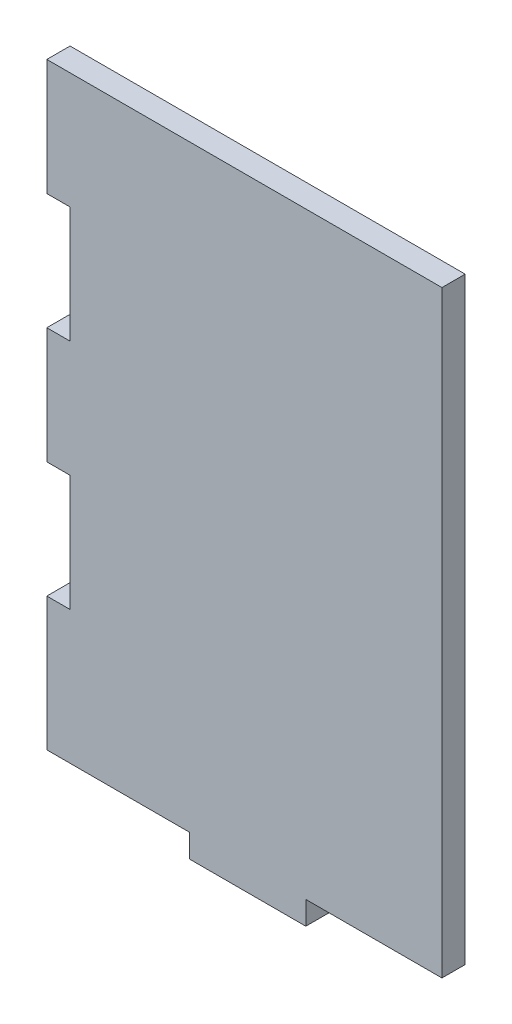
ISO-10303-21;
HEADER;
FILE_DESCRIPTION(('STEP AP214'),'2;1');
FILE_NAME('part.step','',(''),(''),'','','');
FILE_SCHEMA(('AUTOMOTIVE_DESIGN { 1 0 10303 214 1 1 1 1 }'));
ENDSEC;
DATA;
#1=APPLICATION_CONTEXT('core data for automotive mechanical design processes');
#2=APPLICATION_PROTOCOL_DEFINITION('international standard','automotive_design',2000,#1);
#3=PRODUCT_CONTEXT('',#1,'mechanical');
#4=PRODUCT('Part','Part','',(#3));
#5=PRODUCT_RELATED_PRODUCT_CATEGORY('part','',(#4));
#6=PRODUCT_DEFINITION_FORMATION('','',#4);
#7=PRODUCT_DEFINITION_CONTEXT('part definition',#1,'design');
#8=PRODUCT_DEFINITION('design','',#6,#7);
#9=PRODUCT_DEFINITION_SHAPE('','',#8);
#10=(LENGTH_UNIT() NAMED_UNIT(*) SI_UNIT(.MILLI.,.METRE.));
#11=(NAMED_UNIT(*) PLANE_ANGLE_UNIT() SI_UNIT($,.RADIAN.));
#12=(NAMED_UNIT(*) SI_UNIT($,.STERADIAN.) SOLID_ANGLE_UNIT());
#13=UNCERTAINTY_MEASURE_WITH_UNIT(LENGTH_MEASURE(1.E-05),#10,'distance_accuracy_value','');
#14=(GEOMETRIC_REPRESENTATION_CONTEXT(3) GLOBAL_UNCERTAINTY_ASSIGNED_CONTEXT((#13)) GLOBAL_UNIT_ASSIGNED_CONTEXT((#10,
#11,#12)) REPRESENTATION_CONTEXT('',''));
#15=CARTESIAN_POINT('',(0.,0.,0.));
#16=DIRECTION('',(0.,0.,1.));
#17=DIRECTION('',(1.,0.,0.));
#18=AXIS2_PLACEMENT_3D('',#15,#16,#17);
#19=CARTESIAN_POINT('',(-17.0042904946968,25.733568289013,2.));
#20=DIRECTION('',(1.,0.,0.));
#21=DIRECTION('',(0.,0.,-1.));
#22=AXIS2_PLACEMENT_3D('',#19,#20,#21);
#23=PLANE('',#22);
#24=DIRECTION('',(0.,-1.,0.));
#25=VECTOR('',#24,1.);
#26=CARTESIAN_POINT('',(-17.0042904946968,25.733568289013,0.));
#27=LINE('',#26,#25);
#28=CARTESIAN_POINT('',(-17.0042904946968,5.73356828901296,0.));
#29=VERTEX_POINT('',#28);
#30=CARTESIAN_POINT('',(-17.0042904946968,-4.26643171098704,0.));
#31=VERTEX_POINT('',#30);
#32=EDGE_CURVE('E242',#29,#31,#27,.T.);
#33=ORIENTED_EDGE('',*,*,#32,.T.);
#34=DIRECTION('',(0.,0.,-1.));
#35=VECTOR('',#34,1.);
#36=CARTESIAN_POINT('',(-17.0042904946968,-4.26643171098704,0.));
#37=LINE('',#36,#35);
#38=CARTESIAN_POINT('',(-17.0042904946968,-4.26643171098704,2.));
#39=VERTEX_POINT('',#38);
#40=EDGE_CURVE('E162',#39,#31,#37,.T.);
#41=ORIENTED_EDGE('',*,*,#40,.F.);
#42=DIRECTION('',(0.,-1.,0.));
#43=VECTOR('',#42,1.);
#44=CARTESIAN_POINT('',(-17.0042904946968,25.733568289013,2.));
#45=LINE('',#44,#43);
#46=CARTESIAN_POINT('',(-17.0042904946968,5.73356828901296,2.));
#47=VERTEX_POINT('',#46);
#48=EDGE_CURVE('E228',#47,#39,#45,.T.);
#49=ORIENTED_EDGE('',*,*,#48,.F.);
#50=DIRECTION('',(0.,0.,1.));
#51=VECTOR('',#50,1.);
#52=CARTESIAN_POINT('',(-17.0042904946968,5.73356828901296,0.));
#53=LINE('',#52,#51);
#54=EDGE_CURVE('E184',#29,#47,#53,.T.);
#55=ORIENTED_EDGE('',*,*,#54,.F.);
#56=EDGE_LOOP('',(#33,#41,#49,#55));
#57=FACE_BOUND('',#56,.T.);
#58=ADVANCED_FACE('F33',(#57),#23,.F.);
#59=CARTESIAN_POINT('',(-17.0042904946968,25.733568289013,0.));
#60=VERTEX_POINT('',#59);
#61=CARTESIAN_POINT('',(-17.0042904946968,15.733568289013,0.));
#62=VERTEX_POINT('',#61);
#63=EDGE_CURVE('E238',#60,#62,#27,.T.);
#64=ORIENTED_EDGE('',*,*,#63,.T.);
#65=DIRECTION('',(0.,0.,-1.));
#66=VECTOR('',#65,1.);
#67=CARTESIAN_POINT('',(-17.0042904946968,15.733568289013,0.));
#68=LINE('',#67,#66);
#69=CARTESIAN_POINT('',(-17.0042904946968,15.733568289013,2.));
#70=VERTEX_POINT('',#69);
#71=EDGE_CURVE('E177',#70,#62,#68,.T.);
#72=ORIENTED_EDGE('',*,*,#71,.F.);
#73=CARTESIAN_POINT('',(-17.0042904946968,25.733568289013,2.));
#74=VERTEX_POINT('',#73);
#75=EDGE_CURVE('E224',#74,#70,#45,.T.);
#76=ORIENTED_EDGE('',*,*,#75,.F.);
#77=DIRECTION('',(0.,0.,-1.));
#78=VECTOR('',#77,1.);
#79=CARTESIAN_POINT('',(-17.0042904946968,25.733568289013,2.));
#80=LINE('',#79,#78);
#81=EDGE_CURVE('E237',#74,#60,#80,.T.);
#82=ORIENTED_EDGE('',*,*,#81,.T.);
#83=EDGE_LOOP('',(#64,#72,#76,#82));
#84=FACE_BOUND('',#83,.T.);
#85=ADVANCED_FACE('F271',(#84),#23,.F.);
#86=CARTESIAN_POINT('',(17.0042904946968,-25.733568289013,2.));
#87=DIRECTION('',(0.,1.,0.));
#88=DIRECTION('',(0.,0.,1.));
#89=AXIS2_PLACEMENT_3D('',#86,#87,#88);
#90=PLANE('',#89);
#91=DIRECTION('',(0.,0.,1.));
#92=VECTOR('',#91,1.);
#93=CARTESIAN_POINT('',(5.28678485922484,-25.733568289013,0.));
#94=LINE('',#93,#92);
#95=CARTESIAN_POINT('',(5.28678485922484,-25.733568289013,0.));
#96=VERTEX_POINT('',#95);
#97=CARTESIAN_POINT('',(5.28678485922484,-25.733568289013,2.));
#98=VERTEX_POINT('',#97);
#99=EDGE_CURVE('E191',#96,#98,#94,.T.);
#100=ORIENTED_EDGE('',*,*,#99,.F.);
#101=DIRECTION('',(1.,0.,0.));
#102=VECTOR('',#101,1.);
#103=CARTESIAN_POINT('',(17.0042904946968,-25.733568289013,0.));
#104=LINE('',#103,#102);
#105=CARTESIAN_POINT('',(17.0042904946968,-25.733568289013,0.));
#106=VERTEX_POINT('',#105);
#107=EDGE_CURVE('E241',#96,#106,#104,.T.);
#108=ORIENTED_EDGE('',*,*,#107,.T.);
#109=DIRECTION('',(0.,0.,-1.));
#110=VECTOR('',#109,1.);
#111=CARTESIAN_POINT('',(17.0042904946968,-25.733568289013,2.));
#112=LINE('',#111,#110);
#113=CARTESIAN_POINT('',(17.0042904946968,-25.733568289013,2.));
#114=VERTEX_POINT('',#113);
#115=EDGE_CURVE('E41',#114,#106,#112,.T.);
#116=ORIENTED_EDGE('',*,*,#115,.F.);
#117=DIRECTION('',(1.,0.,0.));
#118=VECTOR('',#117,1.);
#119=CARTESIAN_POINT('',(17.0042904946968,-25.733568289013,2.));
#120=LINE('',#119,#118);
#121=EDGE_CURVE('E227',#98,#114,#120,.T.);
#122=ORIENTED_EDGE('',*,*,#121,.F.);
#123=EDGE_LOOP('',(#100,#108,#116,#122));
#124=FACE_BOUND('',#123,.T.);
#125=ADVANCED_FACE('F279',(#124),#90,.F.);
#126=DIRECTION('',(0.,0.,-1.));
#127=VECTOR('',#126,1.);
#128=CARTESIAN_POINT('',(-4.71321514077516,-25.733568289013,0.));
#129=LINE('',#128,#127);
#130=CARTESIAN_POINT('',(-4.71321514077516,-25.733568289013,2.));
#131=VERTEX_POINT('',#130);
#132=CARTESIAN_POINT('',(-4.71321514077516,-25.733568289013,0.));
#133=VERTEX_POINT('',#132);
#134=EDGE_CURVE('E202',#131,#133,#129,.T.);
#135=ORIENTED_EDGE('',*,*,#134,.F.);
#136=CARTESIAN_POINT('',(-17.0042904946968,-25.733568289013,2.));
#137=VERTEX_POINT('',#136);
#138=EDGE_CURVE('E230',#137,#131,#120,.T.);
#139=ORIENTED_EDGE('',*,*,#138,.F.);
#140=DIRECTION('',(0.,0.,-1.));
#141=VECTOR('',#140,1.);
#142=CARTESIAN_POINT('',(-17.0042904946968,-25.733568289013,2.));
#143=LINE('',#142,#141);
#144=CARTESIAN_POINT('',(-17.0042904946968,-25.733568289013,0.));
#145=VERTEX_POINT('',#144);
#146=EDGE_CURVE('E11',#137,#145,#143,.T.);
#147=ORIENTED_EDGE('',*,*,#146,.T.);
#148=EDGE_CURVE('E243',#145,#133,#104,.T.);
#149=ORIENTED_EDGE('',*,*,#148,.T.);
#150=EDGE_LOOP('',(#135,#139,#147,#149));
#151=FACE_BOUND('',#150,.T.);
#152=ADVANCED_FACE('F293',(#151),#90,.F.);
#153=CARTESIAN_POINT('',(-17.0042904946968,-14.266431710987,2.));
#154=VERTEX_POINT('',#153);
#155=EDGE_CURVE('E229',#154,#137,#45,.T.);
#156=ORIENTED_EDGE('',*,*,#155,.F.);
#157=DIRECTION('',(0.,0.,1.));
#158=VECTOR('',#157,1.);
#159=CARTESIAN_POINT('',(-17.0042904946968,-14.266431710987,0.));
#160=LINE('',#159,#158);
#161=CARTESIAN_POINT('',(-17.0042904946968,-14.266431710987,0.));
#162=VERTEX_POINT('',#161);
#163=EDGE_CURVE('E305',#162,#154,#160,.T.);
#164=ORIENTED_EDGE('',*,*,#163,.F.);
#165=EDGE_CURVE('E167',#162,#145,#27,.T.);
#166=ORIENTED_EDGE('',*,*,#165,.T.);
#167=ORIENTED_EDGE('',*,*,#146,.F.);
#168=EDGE_LOOP('',(#156,#164,#166,#167));
#169=FACE_BOUND('',#168,.T.);
#170=ADVANCED_FACE('F35',(#169),#23,.F.);
#171=CARTESIAN_POINT('',(17.0042904946968,25.733568289013,2.));
#172=DIRECTION('',(-1.,0.,0.));
#173=DIRECTION('',(0.,0.,1.));
#174=AXIS2_PLACEMENT_3D('',#171,#172,#173);
#175=PLANE('',#174);
#176=DIRECTION('',(0.,1.,0.));
#177=VECTOR('',#176,1.);
#178=CARTESIAN_POINT('',(17.0042904946968,25.733568289013,0.));
#179=LINE('',#178,#177);
#180=CARTESIAN_POINT('',(17.0042904946968,25.733568289013,0.));
#181=VERTEX_POINT('',#180);
#182=EDGE_CURVE('E245',#106,#181,#179,.T.);
#183=ORIENTED_EDGE('',*,*,#182,.T.);
#184=DIRECTION('',(0.,0.,-1.));
#185=VECTOR('',#184,1.);
#186=CARTESIAN_POINT('',(17.0042904946968,25.733568289013,2.));
#187=LINE('',#186,#185);
#188=CARTESIAN_POINT('',(17.0042904946968,25.733568289013,2.));
#189=VERTEX_POINT('',#188);
#190=EDGE_CURVE('E251',#189,#181,#187,.T.);
#191=ORIENTED_EDGE('',*,*,#190,.F.);
#192=DIRECTION('',(0.,1.,0.));
#193=VECTOR('',#192,1.);
#194=CARTESIAN_POINT('',(17.0042904946968,25.733568289013,2.));
#195=LINE('',#194,#193);
#196=EDGE_CURVE('E233',#114,#189,#195,.T.);
#197=ORIENTED_EDGE('',*,*,#196,.F.);
#198=ORIENTED_EDGE('',*,*,#115,.T.);
#199=EDGE_LOOP('',(#183,#191,#197,#198));
#200=FACE_BOUND('',#199,.T.);
#201=ADVANCED_FACE('F258',(#200),#175,.F.);
#202=CARTESIAN_POINT('',(17.0042904946968,25.733568289013,2.));
#203=DIRECTION('',(0.,-1.,0.));
#204=DIRECTION('',(0.,0.,-1.));
#205=AXIS2_PLACEMENT_3D('',#202,#203,#204);
#206=PLANE('',#205);
#207=DIRECTION('',(-1.,0.,0.));
#208=VECTOR('',#207,1.);
#209=CARTESIAN_POINT('',(17.0042904946968,25.733568289013,0.));
#210=LINE('',#209,#208);
#211=EDGE_CURVE('E247',#181,#60,#210,.T.);
#212=ORIENTED_EDGE('',*,*,#211,.T.);
#213=ORIENTED_EDGE('',*,*,#81,.F.);
#214=DIRECTION('',(-1.,0.,0.));
#215=VECTOR('',#214,1.);
#216=CARTESIAN_POINT('',(17.0042904946968,25.733568289013,2.));
#217=LINE('',#216,#215);
#218=EDGE_CURVE('E235',#189,#74,#217,.T.);
#219=ORIENTED_EDGE('',*,*,#218,.F.);
#220=ORIENTED_EDGE('',*,*,#190,.T.);
#221=EDGE_LOOP('',(#212,#213,#219,#220));
#222=FACE_BOUND('',#221,.T.);
#223=ADVANCED_FACE('F267',(#222),#206,.F.);
#224=CARTESIAN_POINT('',(0.,0.,2.));
#225=DIRECTION('',(0.,0.,-1.));
#226=DIRECTION('',(-1.,0.,0.));
#227=AXIS2_PLACEMENT_3D('',#224,#225,#226);
#228=PLANE('',#227);
#229=ORIENTED_EDGE('',*,*,#48,.T.);
#230=DIRECTION('',(-1.,0.,0.));
#231=VECTOR('',#230,1.);
#232=CARTESIAN_POINT('',(-15.0042904946968,-4.26643171098704,2.));
#233=LINE('',#232,#231);
#234=CARTESIAN_POINT('',(-15.0042904946968,-4.26643171098704,2.));
#235=VERTEX_POINT('',#234);
#236=EDGE_CURVE('E169',#235,#39,#233,.T.);
#237=ORIENTED_EDGE('',*,*,#236,.F.);
#238=DIRECTION('',(0.,1.,0.));
#239=VECTOR('',#238,1.);
#240=CARTESIAN_POINT('',(-15.0042904946968,-4.26643171098704,2.));
#241=LINE('',#240,#239);
#242=CARTESIAN_POINT('',(-15.0042904946968,-14.266431710987,2.));
#243=VERTEX_POINT('',#242);
#244=EDGE_CURVE('E155',#243,#235,#241,.T.);
#245=ORIENTED_EDGE('',*,*,#244,.F.);
#246=DIRECTION('',(-1.,0.,0.));
#247=VECTOR('',#246,1.);
#248=CARTESIAN_POINT('',(-15.0042904946968,-14.266431710987,2.));
#249=LINE('',#248,#247);
#250=EDGE_CURVE('E153',#243,#154,#249,.T.);
#251=ORIENTED_EDGE('',*,*,#250,.T.);
#252=ORIENTED_EDGE('',*,*,#155,.T.);
#253=ORIENTED_EDGE('',*,*,#138,.T.);
#254=DIRECTION('',(0.,1.,0.));
#255=VECTOR('',#254,1.);
#256=CARTESIAN_POINT('',(-4.71321514077516,-27.733568289013,2.));
#257=LINE('',#256,#255);
#258=CARTESIAN_POINT('',(-4.71321514077516,-27.733568289013,2.));
#259=VERTEX_POINT('',#258);
#260=EDGE_CURVE('E218',#259,#131,#257,.T.);
#261=ORIENTED_EDGE('',*,*,#260,.F.);
#262=DIRECTION('',(-1.,0.,0.));
#263=VECTOR('',#262,1.);
#264=CARTESIAN_POINT('',(5.28678485922484,-27.733568289013,2.));
#265=LINE('',#264,#263);
#266=CARTESIAN_POINT('',(5.28678485922484,-27.733568289013,2.));
#267=VERTEX_POINT('',#266);
#268=EDGE_CURVE('E201',#267,#259,#265,.T.);
#269=ORIENTED_EDGE('',*,*,#268,.F.);
#270=DIRECTION('',(0.,1.,0.));
#271=VECTOR('',#270,1.);
#272=CARTESIAN_POINT('',(5.28678485922484,-27.733568289013,2.));
#273=LINE('',#272,#271);
#274=EDGE_CURVE('E221',#267,#98,#273,.T.);
#275=ORIENTED_EDGE('',*,*,#274,.T.);
#276=ORIENTED_EDGE('',*,*,#121,.T.);
#277=ORIENTED_EDGE('',*,*,#196,.T.);
#278=ORIENTED_EDGE('',*,*,#218,.T.);
#279=ORIENTED_EDGE('',*,*,#75,.T.);
#280=DIRECTION('',(-1.,0.,0.));
#281=VECTOR('',#280,1.);
#282=CARTESIAN_POINT('',(-15.0042904946968,15.733568289013,2.));
#283=LINE('',#282,#281);
#284=CARTESIAN_POINT('',(-15.0042904946968,15.733568289013,2.));
#285=VERTEX_POINT('',#284);
#286=EDGE_CURVE('E192',#285,#70,#283,.T.);
#287=ORIENTED_EDGE('',*,*,#286,.F.);
#288=DIRECTION('',(0.,1.,0.));
#289=VECTOR('',#288,1.);
#290=CARTESIAN_POINT('',(-15.0042904946968,15.733568289013,2.));
#291=LINE('',#290,#289);
#292=CARTESIAN_POINT('',(-15.0042904946968,5.73356828901296,2.));
#293=VERTEX_POINT('',#292);
#294=EDGE_CURVE('E180',#293,#285,#291,.T.);
#295=ORIENTED_EDGE('',*,*,#294,.F.);
#296=DIRECTION('',(-1.,0.,0.));
#297=VECTOR('',#296,1.);
#298=CARTESIAN_POINT('',(-15.0042904946968,5.73356828901296,2.));
#299=LINE('',#298,#297);
#300=EDGE_CURVE('E194',#293,#47,#299,.T.);
#301=ORIENTED_EDGE('',*,*,#300,.T.);
#302=EDGE_LOOP('',(#229,#237,#245,#251,#252,#253,#261,#269,#275,#276,#277,#278,#279,#287,#295,#301));
#303=FACE_BOUND('',#302,.T.);
#304=ADVANCED_FACE('F276',(#303),#228,.F.);
#305=CARTESIAN_POINT('',(0.,0.,0.));
#306=DIRECTION('',(0.,0.,-1.));
#307=DIRECTION('',(-1.,0.,0.));
#308=AXIS2_PLACEMENT_3D('',#305,#306,#307);
#309=PLANE('',#308);
#310=DIRECTION('',(-1.,0.,0.));
#311=VECTOR('',#310,1.);
#312=CARTESIAN_POINT('',(-15.0042904946968,-4.26643171098704,0.));
#313=LINE('',#312,#311);
#314=CARTESIAN_POINT('',(-15.0042904946968,-4.26643171098704,0.));
#315=VERTEX_POINT('',#314);
#316=EDGE_CURVE('E186',#315,#31,#313,.T.);
#317=ORIENTED_EDGE('',*,*,#316,.T.);
#318=ORIENTED_EDGE('',*,*,#32,.F.);
#319=DIRECTION('',(-1.,0.,0.));
#320=VECTOR('',#319,1.);
#321=CARTESIAN_POINT('',(-15.0042904946968,5.73356828901296,0.));
#322=LINE('',#321,#320);
#323=CARTESIAN_POINT('',(-15.0042904946968,5.73356828901296,0.));
#324=VERTEX_POINT('',#323);
#325=EDGE_CURVE('E183',#324,#29,#322,.T.);
#326=ORIENTED_EDGE('',*,*,#325,.F.);
#327=DIRECTION('',(0.,-1.,0.));
#328=VECTOR('',#327,1.);
#329=CARTESIAN_POINT('',(-15.0042904946968,15.733568289013,0.));
#330=LINE('',#329,#328);
#331=CARTESIAN_POINT('',(-15.0042904946968,15.733568289013,0.));
#332=VERTEX_POINT('',#331);
#333=EDGE_CURVE('E174',#332,#324,#330,.T.);
#334=ORIENTED_EDGE('',*,*,#333,.F.);
#335=DIRECTION('',(-1.,0.,0.));
#336=VECTOR('',#335,1.);
#337=CARTESIAN_POINT('',(-15.0042904946968,15.733568289013,0.));
#338=LINE('',#337,#336);
#339=EDGE_CURVE('E188',#332,#62,#338,.T.);
#340=ORIENTED_EDGE('',*,*,#339,.T.);
#341=ORIENTED_EDGE('',*,*,#63,.F.);
#342=ORIENTED_EDGE('',*,*,#211,.F.);
#343=ORIENTED_EDGE('',*,*,#182,.F.);
#344=ORIENTED_EDGE('',*,*,#107,.F.);
#345=DIRECTION('',(0.,1.,0.));
#346=VECTOR('',#345,1.);
#347=CARTESIAN_POINT('',(5.28678485922484,-27.733568289013,0.));
#348=LINE('',#347,#346);
#349=CARTESIAN_POINT('',(5.28678485922484,-27.733568289013,0.));
#350=VERTEX_POINT('',#349);
#351=EDGE_CURVE('E208',#350,#96,#348,.T.);
#352=ORIENTED_EDGE('',*,*,#351,.F.);
#353=DIRECTION('',(1.,0.,0.));
#354=VECTOR('',#353,1.);
#355=CARTESIAN_POINT('',(5.28678485922484,-27.733568289013,0.));
#356=LINE('',#355,#354);
#357=CARTESIAN_POINT('',(-4.71321514077516,-27.733568289013,0.));
#358=VERTEX_POINT('',#357);
#359=EDGE_CURVE('E206',#358,#350,#356,.T.);
#360=ORIENTED_EDGE('',*,*,#359,.F.);
#361=DIRECTION('',(0.,1.,0.));
#362=VECTOR('',#361,1.);
#363=CARTESIAN_POINT('',(-4.71321514077516,-27.733568289013,0.));
#364=LINE('',#363,#362);
#365=EDGE_CURVE('E215',#358,#133,#364,.T.);
#366=ORIENTED_EDGE('',*,*,#365,.T.);
#367=ORIENTED_EDGE('',*,*,#148,.F.);
#368=ORIENTED_EDGE('',*,*,#165,.F.);
#369=DIRECTION('',(-1.,0.,0.));
#370=VECTOR('',#369,1.);
#371=CARTESIAN_POINT('',(-15.0042904946968,-14.266431710987,0.));
#372=LINE('',#371,#370);
#373=CARTESIAN_POINT('',(-15.0042904946968,-14.266431710987,0.));
#374=VERTEX_POINT('',#373);
#375=EDGE_CURVE('E150',#374,#162,#372,.T.);
#376=ORIENTED_EDGE('',*,*,#375,.F.);
#377=DIRECTION('',(0.,-1.,0.));
#378=VECTOR('',#377,1.);
#379=CARTESIAN_POINT('',(-15.0042904946968,-4.26643171098704,0.));
#380=LINE('',#379,#378);
#381=EDGE_CURVE('E156',#315,#374,#380,.T.);
#382=ORIENTED_EDGE('',*,*,#381,.F.);
#383=EDGE_LOOP('',(#317,#318,#326,#334,#340,#341,#342,#343,#344,#352,#360,#366,#367,#368,#376,#382));
#384=FACE_BOUND('',#383,.T.);
#385=ADVANCED_FACE('F165',(#384),#309,.T.);
#386=CARTESIAN_POINT('',(5.28678485922484,-27.733568289013,0.));
#387=DIRECTION('',(-1.,0.,0.));
#388=DIRECTION('',(0.,0.,1.));
#389=AXIS2_PLACEMENT_3D('',#386,#387,#388);
#390=PLANE('',#389);
#391=ORIENTED_EDGE('',*,*,#99,.T.);
#392=ORIENTED_EDGE('',*,*,#274,.F.);
#393=DIRECTION('',(0.,0.,1.));
#394=VECTOR('',#393,1.);
#395=CARTESIAN_POINT('',(5.28678485922484,-27.733568289013,0.));
#396=LINE('',#395,#394);
#397=EDGE_CURVE('E198',#350,#267,#396,.T.);
#398=ORIENTED_EDGE('',*,*,#397,.F.);
#399=ORIENTED_EDGE('',*,*,#351,.T.);
#400=EDGE_LOOP('',(#391,#392,#398,#399));
#401=FACE_BOUND('',#400,.T.);
#402=ADVANCED_FACE('F281',(#401),#390,.F.);
#403=CARTESIAN_POINT('',(-4.71321514077516,-27.733568289013,0.));
#404=DIRECTION('',(1.,0.,0.));
#405=DIRECTION('',(0.,0.,-1.));
#406=AXIS2_PLACEMENT_3D('',#403,#404,#405);
#407=PLANE('',#406);
#408=ORIENTED_EDGE('',*,*,#134,.T.);
#409=ORIENTED_EDGE('',*,*,#365,.F.);
#410=DIRECTION('',(0.,0.,-1.));
#411=VECTOR('',#410,1.);
#412=CARTESIAN_POINT('',(-4.71321514077516,-27.733568289013,0.));
#413=LINE('',#412,#411);
#414=EDGE_CURVE('E204',#259,#358,#413,.T.);
#415=ORIENTED_EDGE('',*,*,#414,.F.);
#416=ORIENTED_EDGE('',*,*,#260,.T.);
#417=EDGE_LOOP('',(#408,#409,#415,#416));
#418=FACE_BOUND('',#417,.T.);
#419=ADVANCED_FACE('F290',(#418),#407,.F.);
#420=CARTESIAN_POINT('',(0.,-27.733568289013,0.));
#421=DIRECTION('',(0.,-1.,0.));
#422=DIRECTION('',(0.,0.,-1.));
#423=AXIS2_PLACEMENT_3D('',#420,#421,#422);
#424=PLANE('',#423);
#425=ORIENTED_EDGE('',*,*,#397,.T.);
#426=ORIENTED_EDGE('',*,*,#268,.T.);
#427=ORIENTED_EDGE('',*,*,#414,.T.);
#428=ORIENTED_EDGE('',*,*,#359,.T.);
#429=EDGE_LOOP('',(#425,#426,#427,#428));
#430=FACE_BOUND('',#429,.T.);
#431=ADVANCED_FACE('F286',(#430),#424,.T.);
#432=CARTESIAN_POINT('',(-15.0042904946968,15.733568289013,0.));
#433=DIRECTION('',(0.,1.,0.));
#434=DIRECTION('',(0.,0.,1.));
#435=AXIS2_PLACEMENT_3D('',#432,#433,#434);
#436=PLANE('',#435);
#437=ORIENTED_EDGE('',*,*,#71,.T.);
#438=ORIENTED_EDGE('',*,*,#339,.F.);
#439=DIRECTION('',(0.,0.,-1.));
#440=VECTOR('',#439,1.);
#441=CARTESIAN_POINT('',(-15.0042904946968,15.733568289013,0.));
#442=LINE('',#441,#440);
#443=EDGE_CURVE('E56',#285,#332,#442,.T.);
#444=ORIENTED_EDGE('',*,*,#443,.F.);
#445=ORIENTED_EDGE('',*,*,#286,.T.);
#446=EDGE_LOOP('',(#437,#438,#444,#445));
#447=FACE_BOUND('',#446,.T.);
#448=ADVANCED_FACE('F338',(#447),#436,.F.);
#449=CARTESIAN_POINT('',(-15.0042904946968,5.73356828901296,0.));
#450=DIRECTION('',(0.,-1.,0.));
#451=DIRECTION('',(0.,0.,-1.));
#452=AXIS2_PLACEMENT_3D('',#449,#450,#451);
#453=PLANE('',#452);
#454=ORIENTED_EDGE('',*,*,#54,.T.);
#455=ORIENTED_EDGE('',*,*,#300,.F.);
#456=DIRECTION('',(0.,0.,1.));
#457=VECTOR('',#456,1.);
#458=CARTESIAN_POINT('',(-15.0042904946968,5.73356828901296,0.));
#459=LINE('',#458,#457);
#460=EDGE_CURVE('E176',#324,#293,#459,.T.);
#461=ORIENTED_EDGE('',*,*,#460,.F.);
#462=ORIENTED_EDGE('',*,*,#325,.T.);
#463=EDGE_LOOP('',(#454,#455,#461,#462));
#464=FACE_BOUND('',#463,.T.);
#465=ADVANCED_FACE('F339',(#464),#453,.F.);
#466=CARTESIAN_POINT('',(-15.0042904946968,0.,0.));
#467=DIRECTION('',(-1.,0.,0.));
#468=DIRECTION('',(0.,0.,1.));
#469=AXIS2_PLACEMENT_3D('',#466,#467,#468);
#470=PLANE('',#469);
#471=ORIENTED_EDGE('',*,*,#333,.T.);
#472=ORIENTED_EDGE('',*,*,#460,.T.);
#473=ORIENTED_EDGE('',*,*,#294,.T.);
#474=ORIENTED_EDGE('',*,*,#443,.T.);
#475=EDGE_LOOP('',(#471,#472,#473,#474));
#476=FACE_BOUND('',#475,.T.);
#477=ADVANCED_FACE('F342',(#476),#470,.T.);
#478=CARTESIAN_POINT('',(-15.0042904946968,-4.26643171098704,0.));
#479=DIRECTION('',(0.,1.,0.));
#480=DIRECTION('',(0.,0.,1.));
#481=AXIS2_PLACEMENT_3D('',#478,#479,#480);
#482=PLANE('',#481);
#483=ORIENTED_EDGE('',*,*,#40,.T.);
#484=ORIENTED_EDGE('',*,*,#316,.F.);
#485=DIRECTION('',(0.,0.,-1.));
#486=VECTOR('',#485,1.);
#487=CARTESIAN_POINT('',(-15.0042904946968,-4.26643171098704,0.));
#488=LINE('',#487,#486);
#489=EDGE_CURVE('E48',#235,#315,#488,.T.);
#490=ORIENTED_EDGE('',*,*,#489,.F.);
#491=ORIENTED_EDGE('',*,*,#236,.T.);
#492=EDGE_LOOP('',(#483,#484,#490,#491));
#493=FACE_BOUND('',#492,.T.);
#494=ADVANCED_FACE('F309',(#493),#482,.F.);
#495=CARTESIAN_POINT('',(-15.0042904946968,-14.266431710987,0.));
#496=DIRECTION('',(0.,-1.,0.));
#497=DIRECTION('',(0.,0.,-1.));
#498=AXIS2_PLACEMENT_3D('',#495,#496,#497);
#499=PLANE('',#498);
#500=ORIENTED_EDGE('',*,*,#163,.T.);
#501=ORIENTED_EDGE('',*,*,#250,.F.);
#502=DIRECTION('',(0.,0.,1.));
#503=VECTOR('',#502,1.);
#504=CARTESIAN_POINT('',(-15.0042904946968,-14.266431710987,0.));
#505=LINE('',#504,#503);
#506=EDGE_CURVE('E147',#374,#243,#505,.T.);
#507=ORIENTED_EDGE('',*,*,#506,.F.);
#508=ORIENTED_EDGE('',*,*,#375,.T.);
#509=EDGE_LOOP('',(#500,#501,#507,#508));
#510=FACE_BOUND('',#509,.T.);
#511=ADVANCED_FACE('F148',(#510),#499,.F.);
#512=CARTESIAN_POINT('',(-15.0042904946968,0.,0.));
#513=DIRECTION('',(-1.,0.,0.));
#514=DIRECTION('',(0.,0.,1.));
#515=AXIS2_PLACEMENT_3D('',#512,#513,#514);
#516=PLANE('',#515);
#517=ORIENTED_EDGE('',*,*,#381,.T.);
#518=ORIENTED_EDGE('',*,*,#506,.T.);
#519=ORIENTED_EDGE('',*,*,#244,.T.);
#520=ORIENTED_EDGE('',*,*,#489,.T.);
#521=EDGE_LOOP('',(#517,#518,#519,#520));
#522=FACE_BOUND('',#521,.T.);
#523=ADVANCED_FACE('F159',(#522),#516,.T.);
#524=CLOSED_SHELL('',(#58,#85,#125,#152,#170,#201,#223,#304,#385,#402,#419,#431,#448,#465,#477,
#494,#511,#523));
#525=MANIFOLD_SOLID_BREP('B2',#524);
#526=ADVANCED_BREP_SHAPE_REPRESENTATION('',(#18,#525),#14);
#527=SHAPE_DEFINITION_REPRESENTATION(#9,#526);
ENDSEC;
END-ISO-10303-21;
